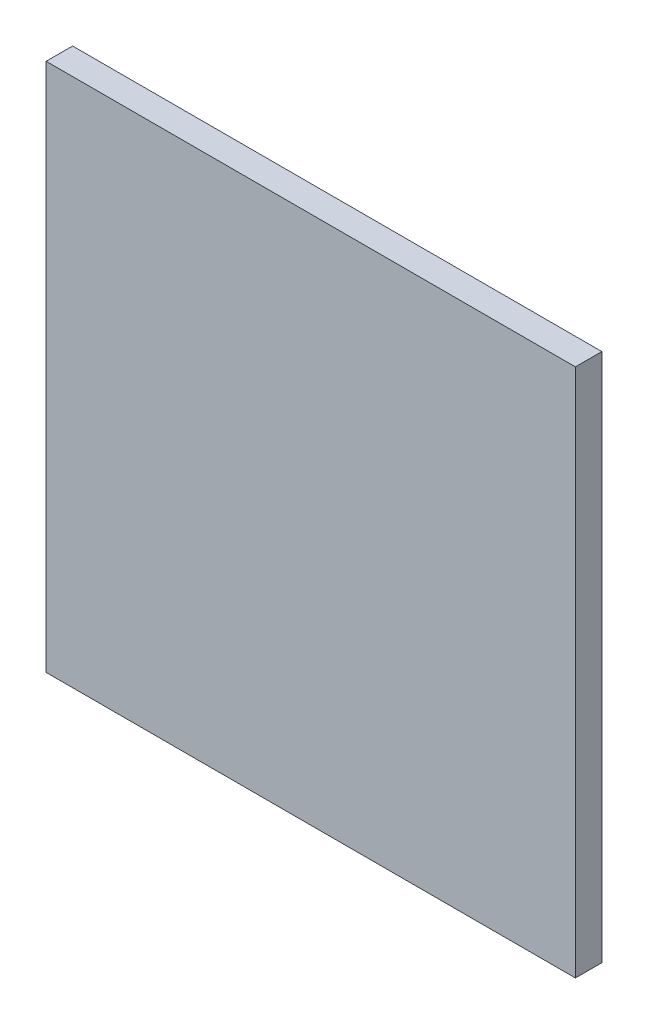
ISO-10303-21;
HEADER;
FILE_DESCRIPTION(('STEP AP214'),'2;1');
FILE_NAME('part.step','',(''),(''),'','','');
FILE_SCHEMA(('AUTOMOTIVE_DESIGN { 1 0 10303 214 1 1 1 1 }'));
ENDSEC;
DATA;
#1=APPLICATION_CONTEXT('core data for automotive mechanical design processes');
#2=APPLICATION_PROTOCOL_DEFINITION('international standard','automotive_design',2000,#1);
#3=PRODUCT_CONTEXT('',#1,'mechanical');
#4=PRODUCT('Part','Part','',(#3));
#5=PRODUCT_RELATED_PRODUCT_CATEGORY('part','',(#4));
#6=PRODUCT_DEFINITION_FORMATION('','',#4);
#7=PRODUCT_DEFINITION_CONTEXT('part definition',#1,'design');
#8=PRODUCT_DEFINITION('design','',#6,#7);
#9=PRODUCT_DEFINITION_SHAPE('','',#8);
#10=(LENGTH_UNIT() NAMED_UNIT(*) SI_UNIT(.MILLI.,.METRE.));
#11=(NAMED_UNIT(*) PLANE_ANGLE_UNIT() SI_UNIT($,.RADIAN.));
#12=(NAMED_UNIT(*) SI_UNIT($,.STERADIAN.) SOLID_ANGLE_UNIT());
#13=UNCERTAINTY_MEASURE_WITH_UNIT(LENGTH_MEASURE(1.E-05),#10,'distance_accuracy_value','');
#14=(GEOMETRIC_REPRESENTATION_CONTEXT(3) GLOBAL_UNCERTAINTY_ASSIGNED_CONTEXT((#13)) GLOBAL_UNIT_ASSIGNED_CONTEXT((#10,
#11,#12)) REPRESENTATION_CONTEXT('',''));
#15=CARTESIAN_POINT('',(0.,0.,0.));
#16=DIRECTION('',(0.,0.,1.));
#17=DIRECTION('',(1.,0.,0.));
#18=AXIS2_PLACEMENT_3D('',#15,#16,#17);
#19=CARTESIAN_POINT('',(0.,0.,-500.));
#20=DIRECTION('',(-1.,0.,0.));
#21=DIRECTION('',(0.,0.,1.));
#22=AXIS2_PLACEMENT_3D('',#19,#20,#21);
#23=PLANE('',#22);
#24=DIRECTION('',(0.,-1.,0.));
#25=VECTOR('',#24,1.);
#26=CARTESIAN_POINT('',(0.,0.,0.));
#27=LINE('',#26,#25);
#28=CARTESIAN_POINT('',(0.,10000.,0.));
#29=VERTEX_POINT('',#28);
#30=CARTESIAN_POINT('',(0.,0.,0.));
#31=VERTEX_POINT('',#30);
#32=EDGE_CURVE('E97',#29,#31,#27,.T.);
#33=ORIENTED_EDGE('',*,*,#32,.F.);
#34=DIRECTION('',(0.,0.,1.));
#35=VECTOR('',#34,1.);
#36=CARTESIAN_POINT('',(0.,10000.,-500.));
#37=LINE('',#36,#35);
#38=CARTESIAN_POINT('',(0.,10000.,-500.));
#39=VERTEX_POINT('',#38);
#40=EDGE_CURVE('E11',#39,#29,#37,.T.);
#41=ORIENTED_EDGE('',*,*,#40,.F.);
#42=DIRECTION('',(0.,-1.,0.));
#43=VECTOR('',#42,1.);
#44=CARTESIAN_POINT('',(0.,0.,-500.));
#45=LINE('',#44,#43);
#46=CARTESIAN_POINT('',(0.,0.,-500.));
#47=VERTEX_POINT('',#46);
#48=EDGE_CURVE('E91',#39,#47,#45,.T.);
#49=ORIENTED_EDGE('',*,*,#48,.T.);
#50=DIRECTION('',(0.,0.,1.));
#51=VECTOR('',#50,1.);
#52=CARTESIAN_POINT('',(0.,0.,-500.));
#53=LINE('',#52,#51);
#54=EDGE_CURVE('E36',#47,#31,#53,.T.);
#55=ORIENTED_EDGE('',*,*,#54,.T.);
#56=EDGE_LOOP('',(#33,#41,#49,#55));
#57=FACE_BOUND('',#56,.T.);
#58=ADVANCED_FACE('F33',(#57),#23,.T.);
#59=CARTESIAN_POINT('',(0.,10000.,-500.));
#60=DIRECTION('',(0.,1.,0.));
#61=DIRECTION('',(0.,0.,1.));
#62=AXIS2_PLACEMENT_3D('',#59,#60,#61);
#63=PLANE('',#62);
#64=DIRECTION('',(-1.,0.,0.));
#65=VECTOR('',#64,1.);
#66=CARTESIAN_POINT('',(0.,10000.,0.));
#67=LINE('',#66,#65);
#68=CARTESIAN_POINT('',(10000.,10000.,0.));
#69=VERTEX_POINT('',#68);
#70=EDGE_CURVE('E93',#69,#29,#67,.T.);
#71=ORIENTED_EDGE('',*,*,#70,.F.);
#72=DIRECTION('',(0.,0.,1.));
#73=VECTOR('',#72,1.);
#74=CARTESIAN_POINT('',(10000.,10000.,-500.));
#75=LINE('',#74,#73);
#76=CARTESIAN_POINT('',(10000.,10000.,-500.));
#77=VERTEX_POINT('',#76);
#78=EDGE_CURVE('E42',#77,#69,#75,.T.);
#79=ORIENTED_EDGE('',*,*,#78,.F.);
#80=DIRECTION('',(-1.,0.,0.));
#81=VECTOR('',#80,1.);
#82=CARTESIAN_POINT('',(0.,10000.,-500.));
#83=LINE('',#82,#81);
#84=EDGE_CURVE('E88',#77,#39,#83,.T.);
#85=ORIENTED_EDGE('',*,*,#84,.T.);
#86=ORIENTED_EDGE('',*,*,#40,.T.);
#87=EDGE_LOOP('',(#71,#79,#85,#86));
#88=FACE_BOUND('',#87,.T.);
#89=ADVANCED_FACE('F107',(#88),#63,.T.);
#90=CARTESIAN_POINT('',(10000.,0.,-500.));
#91=DIRECTION('',(1.,0.,0.));
#92=DIRECTION('',(0.,0.,-1.));
#93=AXIS2_PLACEMENT_3D('',#90,#91,#92);
#94=PLANE('',#93);
#95=DIRECTION('',(0.,1.,0.));
#96=VECTOR('',#95,1.);
#97=CARTESIAN_POINT('',(10000.,0.,0.));
#98=LINE('',#97,#96);
#99=CARTESIAN_POINT('',(10000.,0.,0.));
#100=VERTEX_POINT('',#99);
#101=EDGE_CURVE('E83',#100,#69,#98,.T.);
#102=ORIENTED_EDGE('',*,*,#101,.F.);
#103=DIRECTION('',(0.,0.,1.));
#104=VECTOR('',#103,1.);
#105=CARTESIAN_POINT('',(10000.,0.,-500.));
#106=LINE('',#105,#104);
#107=CARTESIAN_POINT('',(10000.,0.,-500.));
#108=VERTEX_POINT('',#107);
#109=EDGE_CURVE('E78',#108,#100,#106,.T.);
#110=ORIENTED_EDGE('',*,*,#109,.F.);
#111=DIRECTION('',(0.,1.,0.));
#112=VECTOR('',#111,1.);
#113=CARTESIAN_POINT('',(10000.,0.,-500.));
#114=LINE('',#113,#112);
#115=EDGE_CURVE('E81',#108,#77,#114,.T.);
#116=ORIENTED_EDGE('',*,*,#115,.T.);
#117=ORIENTED_EDGE('',*,*,#78,.T.);
#118=EDGE_LOOP('',(#102,#110,#116,#117));
#119=FACE_BOUND('',#118,.T.);
#120=ADVANCED_FACE('F80',(#119),#94,.T.);
#121=CARTESIAN_POINT('',(0.,0.,-500.));
#122=DIRECTION('',(0.,-1.,0.));
#123=DIRECTION('',(0.,0.,-1.));
#124=AXIS2_PLACEMENT_3D('',#121,#122,#123);
#125=PLANE('',#124);
#126=DIRECTION('',(1.,0.,0.));
#127=VECTOR('',#126,1.);
#128=CARTESIAN_POINT('',(0.,0.,0.));
#129=LINE('',#128,#127);
#130=EDGE_CURVE('E100',#31,#100,#129,.T.);
#131=ORIENTED_EDGE('',*,*,#130,.F.);
#132=ORIENTED_EDGE('',*,*,#54,.F.);
#133=DIRECTION('',(1.,0.,0.));
#134=VECTOR('',#133,1.);
#135=CARTESIAN_POINT('',(0.,0.,-500.));
#136=LINE('',#135,#134);
#137=EDGE_CURVE('E87',#47,#108,#136,.T.);
#138=ORIENTED_EDGE('',*,*,#137,.T.);
#139=ORIENTED_EDGE('',*,*,#109,.T.);
#140=EDGE_LOOP('',(#131,#132,#138,#139));
#141=FACE_BOUND('',#140,.T.);
#142=ADVANCED_FACE('F90',(#141),#125,.T.);
#143=CARTESIAN_POINT('',(0.,0.,-500.));
#144=DIRECTION('',(0.,0.,-1.));
#145=DIRECTION('',(-1.,0.,0.));
#146=AXIS2_PLACEMENT_3D('',#143,#144,#145);
#147=PLANE('',#146);
#148=ORIENTED_EDGE('',*,*,#48,.F.);
#149=ORIENTED_EDGE('',*,*,#84,.F.);
#150=ORIENTED_EDGE('',*,*,#115,.F.);
#151=ORIENTED_EDGE('',*,*,#137,.F.);
#152=EDGE_LOOP('',(#148,#149,#150,#151));
#153=FACE_BOUND('',#152,.T.);
#154=ADVANCED_FACE('F86',(#153),#147,.T.);
#155=CARTESIAN_POINT('',(0.,0.,0.));
#156=DIRECTION('',(0.,0.,-1.));
#157=DIRECTION('',(-1.,0.,0.));
#158=AXIS2_PLACEMENT_3D('',#155,#156,#157);
#159=PLANE('',#158);
#160=ORIENTED_EDGE('',*,*,#32,.T.);
#161=ORIENTED_EDGE('',*,*,#130,.T.);
#162=ORIENTED_EDGE('',*,*,#101,.T.);
#163=ORIENTED_EDGE('',*,*,#70,.T.);
#164=EDGE_LOOP('',(#160,#161,#162,#163));
#165=FACE_BOUND('',#164,.T.);
#166=ADVANCED_FACE('F106',(#165),#159,.F.);
#167=CLOSED_SHELL('',(#58,#89,#120,#142,#154,#166));
#168=MANIFOLD_SOLID_BREP('B2',#167);
#169=ADVANCED_BREP_SHAPE_REPRESENTATION('',(#18,#168),#14);
#170=SHAPE_DEFINITION_REPRESENTATION(#9,#169);
ENDSEC;
END-ISO-10303-21;
